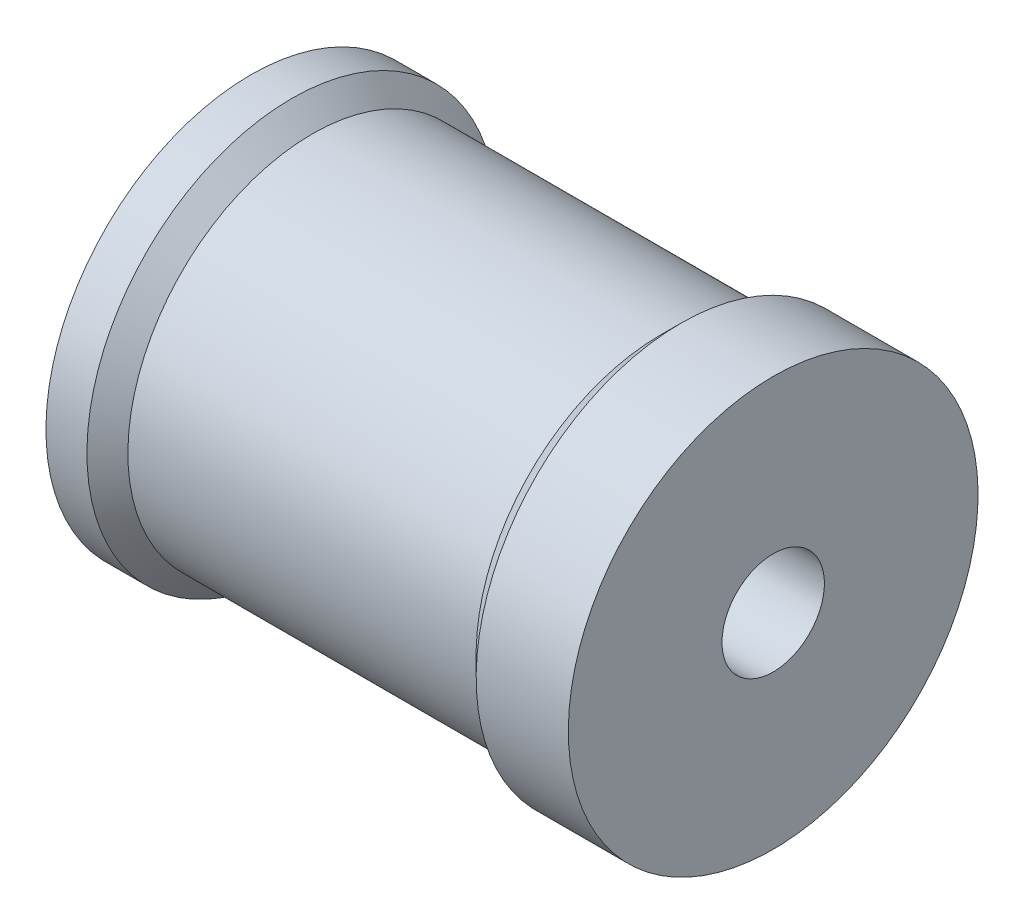
ISO-10303-21;
HEADER;
FILE_DESCRIPTION(('STEP AP214'),'2;1');
FILE_NAME('part.step','',(''),(''),'','','');
FILE_SCHEMA(('AUTOMOTIVE_DESIGN { 1 0 10303 214 1 1 1 1 }'));
ENDSEC;
DATA;
#1=APPLICATION_CONTEXT('core data for automotive mechanical design processes');
#2=APPLICATION_PROTOCOL_DEFINITION('international standard','automotive_design',2000,#1);
#3=PRODUCT_CONTEXT('',#1,'mechanical');
#4=PRODUCT('Part','Part','',(#3));
#5=PRODUCT_RELATED_PRODUCT_CATEGORY('part','',(#4));
#6=PRODUCT_DEFINITION_FORMATION('','',#4);
#7=PRODUCT_DEFINITION_CONTEXT('part definition',#1,'design');
#8=PRODUCT_DEFINITION('design','',#6,#7);
#9=PRODUCT_DEFINITION_SHAPE('','',#8);
#10=(LENGTH_UNIT() NAMED_UNIT(*) SI_UNIT(.MILLI.,.METRE.));
#11=(NAMED_UNIT(*) PLANE_ANGLE_UNIT() SI_UNIT($,.RADIAN.));
#12=(NAMED_UNIT(*) SI_UNIT($,.STERADIAN.) SOLID_ANGLE_UNIT());
#13=UNCERTAINTY_MEASURE_WITH_UNIT(LENGTH_MEASURE(1.E-05),#10,'distance_accuracy_value','');
#14=(GEOMETRIC_REPRESENTATION_CONTEXT(3) GLOBAL_UNCERTAINTY_ASSIGNED_CONTEXT((#13)) GLOBAL_UNIT_ASSIGNED_CONTEXT((#10,
#11,#12)) REPRESENTATION_CONTEXT('',''));
#15=CARTESIAN_POINT('',(0.,0.,0.));
#16=DIRECTION('',(0.,0.,1.));
#17=DIRECTION('',(1.,0.,0.));
#18=AXIS2_PLACEMENT_3D('',#15,#16,#17);
#19=CARTESIAN_POINT('',(25.5,0.,0.));
#20=DIRECTION('',(-1.,0.,0.));
#21=DIRECTION('',(0.,0.,1.));
#22=AXIS2_PLACEMENT_3D('',#19,#20,#21);
#23=CYLINDRICAL_SURFACE('',#22,2.5);
#24=CARTESIAN_POINT('',(0.,0.,0.));
#25=DIRECTION('',(1.,0.,0.));
#26=DIRECTION('',(0.,1.,0.));
#27=AXIS2_PLACEMENT_3D('',#24,#25,#26);
#28=CIRCLE('',#27,2.5);
#29=CARTESIAN_POINT('',(0.,2.5,0.));
#30=VERTEX_POINT('',#29);
#31=EDGE_CURVE('E8',#30,#30,#28,.T.);
#32=ORIENTED_EDGE('',*,*,#31,.F.);
#33=EDGE_LOOP('',(#32));
#34=FACE_BOUND('',#33,.T.);
#35=CARTESIAN_POINT('',(25.5,0.,0.));
#36=DIRECTION('',(-1.,0.,0.));
#37=DIRECTION('',(0.,0.,1.));
#38=AXIS2_PLACEMENT_3D('',#35,#36,#37);
#39=CIRCLE('',#38,2.5);
#40=CARTESIAN_POINT('',(25.5,0.,2.5));
#41=VERTEX_POINT('',#40);
#42=EDGE_CURVE('E29',#41,#41,#39,.T.);
#43=ORIENTED_EDGE('',*,*,#42,.F.);
#44=EDGE_LOOP('',(#43));
#45=FACE_BOUND('',#44,.T.);
#46=ADVANCED_FACE('F13',(#34,#45),#23,.F.);
#47=CARTESIAN_POINT('',(0.,5.,0.));
#48=DIRECTION('',(-1.,0.,0.));
#49=DIRECTION('',(0.,0.,1.));
#50=AXIS2_PLACEMENT_3D('',#47,#48,#49);
#51=PLANE('',#50);
#52=ORIENTED_EDGE('',*,*,#31,.T.);
#53=EDGE_LOOP('',(#52));
#54=FACE_BOUND('',#53,.T.);
#55=CARTESIAN_POINT('',(0.,0.,0.));
#56=DIRECTION('',(1.,0.,0.));
#57=DIRECTION('',(0.,1.,0.));
#58=AXIS2_PLACEMENT_3D('',#55,#56,#57);
#59=CIRCLE('',#58,10.);
#60=CARTESIAN_POINT('',(0.,10.,0.));
#61=VERTEX_POINT('',#60);
#62=EDGE_CURVE('E21',#61,#61,#59,.T.);
#63=ORIENTED_EDGE('',*,*,#62,.F.);
#64=EDGE_LOOP('',(#63));
#65=FACE_BOUND('',#64,.T.);
#66=ADVANCED_FACE('F64',(#54,#65),#51,.T.);
#67=CARTESIAN_POINT('',(0.999999999999997,0.,0.));
#68=DIRECTION('',(1.,0.,0.));
#69=DIRECTION('',(0.,1.,0.));
#70=AXIS2_PLACEMENT_3D('',#67,#68,#69);
#71=CYLINDRICAL_SURFACE('',#70,10.);
#72=CARTESIAN_POINT('',(2.,0.,0.));
#73=DIRECTION('',(1.,0.,0.));
#74=DIRECTION('',(0.,1.,0.));
#75=AXIS2_PLACEMENT_3D('',#72,#73,#74);
#76=CIRCLE('',#75,10.);
#77=CARTESIAN_POINT('',(2.,10.,0.));
#78=VERTEX_POINT('',#77);
#79=EDGE_CURVE('E26',#78,#78,#76,.T.);
#80=ORIENTED_EDGE('',*,*,#79,.F.);
#81=EDGE_LOOP('',(#80));
#82=FACE_BOUND('',#81,.T.);
#83=ORIENTED_EDGE('',*,*,#62,.T.);
#84=EDGE_LOOP('',(#83));
#85=FACE_BOUND('',#84,.T.);
#86=ADVANCED_FACE('F58',(#82,#85),#71,.T.);
#87=CARTESIAN_POINT('',(2.5,0.,0.));
#88=DIRECTION('',(-1.,0.,0.));
#89=DIRECTION('',(0.,1.,0.));
#90=AXIS2_PLACEMENT_3D('',#87,#88,#89);
#91=CONICAL_SURFACE('',#90,9.5,0.785398163397448);
#92=CARTESIAN_POINT('',(3.,0.,0.));
#93=DIRECTION('',(1.,0.,0.));
#94=DIRECTION('',(0.,1.,0.));
#95=AXIS2_PLACEMENT_3D('',#92,#93,#94);
#96=CIRCLE('',#95,9.);
#97=CARTESIAN_POINT('',(3.,9.,0.));
#98=VERTEX_POINT('',#97);
#99=EDGE_CURVE('E35',#98,#98,#96,.T.);
#100=ORIENTED_EDGE('',*,*,#99,.F.);
#101=EDGE_LOOP('',(#100));
#102=FACE_BOUND('',#101,.T.);
#103=ORIENTED_EDGE('',*,*,#79,.T.);
#104=EDGE_LOOP('',(#103));
#105=FACE_BOUND('',#104,.T.);
#106=ADVANCED_FACE('F52',(#102,#105),#91,.T.);
#107=CARTESIAN_POINT('',(11.5,0.,0.));
#108=DIRECTION('',(1.,0.,0.));
#109=DIRECTION('',(0.,1.,0.));
#110=AXIS2_PLACEMENT_3D('',#107,#108,#109);
#111=CYLINDRICAL_SURFACE('',#110,9.);
#112=CARTESIAN_POINT('',(20.,0.,0.));
#113=DIRECTION('',(1.,0.,0.));
#114=DIRECTION('',(0.,1.,0.));
#115=AXIS2_PLACEMENT_3D('',#112,#113,#114);
#116=CIRCLE('',#115,9.);
#117=CARTESIAN_POINT('',(20.,9.,0.));
#118=VERTEX_POINT('',#117);
#119=EDGE_CURVE('E38',#118,#118,#116,.T.);
#120=ORIENTED_EDGE('',*,*,#119,.F.);
#121=EDGE_LOOP('',(#120));
#122=FACE_BOUND('',#121,.T.);
#123=ORIENTED_EDGE('',*,*,#99,.T.);
#124=EDGE_LOOP('',(#123));
#125=FACE_BOUND('',#124,.T.);
#126=ADVANCED_FACE('F47',(#122,#125),#111,.T.);
#127=CARTESIAN_POINT('',(20.5,0.,0.));
#128=DIRECTION('',(1.,0.,0.));
#129=DIRECTION('',(0.,1.,0.));
#130=AXIS2_PLACEMENT_3D('',#127,#128,#129);
#131=CONICAL_SURFACE('',#130,9.5,0.785398163397448);
#132=CARTESIAN_POINT('',(21.,0.,0.));
#133=DIRECTION('',(1.,0.,0.));
#134=DIRECTION('',(0.,1.,0.));
#135=AXIS2_PLACEMENT_3D('',#132,#133,#134);
#136=CIRCLE('',#135,10.);
#137=CARTESIAN_POINT('',(21.,10.,0.));
#138=VERTEX_POINT('',#137);
#139=EDGE_CURVE('E31',#138,#138,#136,.T.);
#140=ORIENTED_EDGE('',*,*,#139,.F.);
#141=EDGE_LOOP('',(#140));
#142=FACE_BOUND('',#141,.T.);
#143=ORIENTED_EDGE('',*,*,#119,.T.);
#144=EDGE_LOOP('',(#143));
#145=FACE_BOUND('',#144,.T.);
#146=ADVANCED_FACE('F44',(#142,#145),#131,.T.);
#147=CARTESIAN_POINT('',(23.25,0.,0.));
#148=DIRECTION('',(1.,0.,0.));
#149=DIRECTION('',(0.,1.,0.));
#150=AXIS2_PLACEMENT_3D('',#147,#148,#149);
#151=CYLINDRICAL_SURFACE('',#150,10.);
#152=CARTESIAN_POINT('',(25.5,0.,0.));
#153=DIRECTION('',(1.,0.,0.));
#154=DIRECTION('',(0.,1.,0.));
#155=AXIS2_PLACEMENT_3D('',#152,#153,#154);
#156=CIRCLE('',#155,10.);
#157=CARTESIAN_POINT('',(25.5,10.,0.));
#158=VERTEX_POINT('',#157);
#159=EDGE_CURVE('E17',#158,#158,#156,.T.);
#160=ORIENTED_EDGE('',*,*,#159,.F.);
#161=EDGE_LOOP('',(#160));
#162=FACE_BOUND('',#161,.T.);
#163=ORIENTED_EDGE('',*,*,#139,.T.);
#164=EDGE_LOOP('',(#163));
#165=FACE_BOUND('',#164,.T.);
#166=ADVANCED_FACE('F15',(#162,#165),#151,.T.);
#167=CARTESIAN_POINT('',(25.5,5.,0.));
#168=DIRECTION('',(1.,0.,0.));
#169=DIRECTION('',(0.,0.,-1.));
#170=AXIS2_PLACEMENT_3D('',#167,#168,#169);
#171=PLANE('',#170);
#172=ORIENTED_EDGE('',*,*,#42,.T.);
#173=EDGE_LOOP('',(#172));
#174=FACE_BOUND('',#173,.T.);
#175=ORIENTED_EDGE('',*,*,#159,.T.);
#176=EDGE_LOOP('',(#175));
#177=FACE_BOUND('',#176,.T.);
#178=ADVANCED_FACE('F77',(#174,#177),#171,.T.);
#179=CLOSED_SHELL('',(#46,#66,#86,#106,#126,#146,#166,#178));
#180=MANIFOLD_SOLID_BREP('B1',#179);
#181=ADVANCED_BREP_SHAPE_REPRESENTATION('',(#18,#180),#14);
#182=SHAPE_DEFINITION_REPRESENTATION(#9,#181);
ENDSEC;
END-ISO-10303-21;
